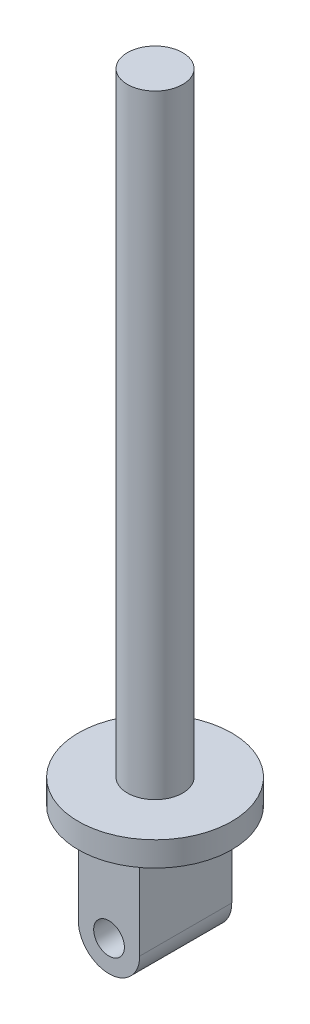
ISO-10303-21;
HEADER;
FILE_DESCRIPTION(('STEP AP214'),'2;1');
FILE_NAME('part.step','',(''),(''),'','','');
FILE_SCHEMA(('AUTOMOTIVE_DESIGN { 1 0 10303 214 1 1 1 1 }'));
ENDSEC;
DATA;
#1=APPLICATION_CONTEXT('core data for automotive mechanical design processes');
#2=APPLICATION_PROTOCOL_DEFINITION('international standard','automotive_design',2000,#1);
#3=PRODUCT_CONTEXT('',#1,'mechanical');
#4=PRODUCT('Part','Part','',(#3));
#5=PRODUCT_RELATED_PRODUCT_CATEGORY('part','',(#4));
#6=PRODUCT_DEFINITION_FORMATION('','',#4);
#7=PRODUCT_DEFINITION_CONTEXT('part definition',#1,'design');
#8=PRODUCT_DEFINITION('design','',#6,#7);
#9=PRODUCT_DEFINITION_SHAPE('','',#8);
#10=(LENGTH_UNIT() NAMED_UNIT(*) SI_UNIT(.MILLI.,.METRE.));
#11=(NAMED_UNIT(*) PLANE_ANGLE_UNIT() SI_UNIT($,.RADIAN.));
#12=(NAMED_UNIT(*) SI_UNIT($,.STERADIAN.) SOLID_ANGLE_UNIT());
#13=UNCERTAINTY_MEASURE_WITH_UNIT(LENGTH_MEASURE(1.E-05),#10,'distance_accuracy_value','');
#14=(GEOMETRIC_REPRESENTATION_CONTEXT(3) GLOBAL_UNCERTAINTY_ASSIGNED_CONTEXT((#13)) GLOBAL_UNIT_ASSIGNED_CONTEXT((#10,
#11,#12)) REPRESENTATION_CONTEXT('',''));
#15=CARTESIAN_POINT('',(0.,0.,0.));
#16=DIRECTION('',(0.,0.,1.));
#17=DIRECTION('',(1.,0.,0.));
#18=AXIS2_PLACEMENT_3D('',#15,#16,#17);
#19=CARTESIAN_POINT('',(25.,-8.,0.));
#20=DIRECTION('',(0.,-1.,0.));
#21=DIRECTION('',(0.,0.,-1.));
#22=AXIS2_PLACEMENT_3D('',#19,#20,#21);
#23=PLANE('',#22);
#24=CARTESIAN_POINT('',(0.,-8.,0.));
#25=DIRECTION('',(0.,-1.,0.));
#26=DIRECTION('',(0.,0.,-1.));
#27=AXIS2_PLACEMENT_3D('',#24,#25,#26);
#28=CIRCLE('',#27,25.);
#29=CARTESIAN_POINT('',(0.,-8.,-25.));
#30=VERTEX_POINT('',#29);
#31=EDGE_CURVE('E94',#30,#30,#28,.T.);
#32=ORIENTED_EDGE('',*,*,#31,.T.);
#33=EDGE_LOOP('',(#32));
#34=FACE_BOUND('',#33,.T.);
#35=DIRECTION('',(-1.,0.,0.));
#36=VECTOR('',#35,1.);
#37=CARTESIAN_POINT('',(-10.,-8.00000000000001,15.));
#38=LINE('',#37,#36);
#39=CARTESIAN_POINT('',(10.,-8.00000000000001,15.));
#40=VERTEX_POINT('',#39);
#41=CARTESIAN_POINT('',(-10.,-8.,15.));
#42=VERTEX_POINT('',#41);
#43=EDGE_CURVE('E82',#40,#42,#38,.T.);
#44=ORIENTED_EDGE('',*,*,#43,.F.);
#45=DIRECTION('',(0.,0.,-1.));
#46=VECTOR('',#45,1.);
#47=CARTESIAN_POINT('',(10.,-8.00000000000001,15.));
#48=LINE('',#47,#46);
#49=CARTESIAN_POINT('',(10.,-8.00000000000001,-15.));
#50=VERTEX_POINT('',#49);
#51=EDGE_CURVE('E88',#40,#50,#48,.T.);
#52=ORIENTED_EDGE('',*,*,#51,.T.);
#53=DIRECTION('',(-1.,0.,0.));
#54=VECTOR('',#53,1.);
#55=CARTESIAN_POINT('',(-10.,-8.00000000000001,-15.));
#56=LINE('',#55,#54);
#57=CARTESIAN_POINT('',(-10.,-8.00000000000001,-15.));
#58=VERTEX_POINT('',#57);
#59=EDGE_CURVE('E104',#50,#58,#56,.T.);
#60=ORIENTED_EDGE('',*,*,#59,.T.);
#61=DIRECTION('',(0.,0.,-1.));
#62=VECTOR('',#61,1.);
#63=CARTESIAN_POINT('',(-10.,-8.00000000000001,15.));
#64=LINE('',#63,#62);
#65=EDGE_CURVE('E95',#42,#58,#64,.T.);
#66=ORIENTED_EDGE('',*,*,#65,.F.);
#67=EDGE_LOOP('',(#44,#52,#60,#66));
#68=FACE_BOUND('',#67,.T.);
#69=ADVANCED_FACE('F34',(#34,#68),#23,.T.);
#70=CARTESIAN_POINT('',(0.,200.,0.));
#71=DIRECTION('',(0.,1.,0.));
#72=DIRECTION('',(0.,0.,1.));
#73=AXIS2_PLACEMENT_3D('',#70,#71,#72);
#74=PLANE('',#73);
#75=CARTESIAN_POINT('',(0.,200.,0.));
#76=DIRECTION('',(0.,-1.,0.));
#77=DIRECTION('',(0.,0.,-1.));
#78=AXIS2_PLACEMENT_3D('',#75,#76,#77);
#79=CIRCLE('',#78,9.00000000000005);
#80=CARTESIAN_POINT('',(0.,200.,-9.00000000000005));
#81=VERTEX_POINT('',#80);
#82=EDGE_CURVE('E11',#81,#81,#79,.T.);
#83=ORIENTED_EDGE('',*,*,#82,.F.);
#84=EDGE_LOOP('',(#83));
#85=FACE_BOUND('',#84,.T.);
#86=ADVANCED_FACE('F126',(#85),#74,.T.);
#87=CARTESIAN_POINT('',(0.,0.,0.));
#88=DIRECTION('',(0.,-1.,0.));
#89=DIRECTION('',(0.,0.,-1.));
#90=AXIS2_PLACEMENT_3D('',#87,#88,#89);
#91=CYLINDRICAL_SURFACE('',#90,9.00000000000004);
#92=ORIENTED_EDGE('',*,*,#82,.T.);
#93=EDGE_LOOP('',(#92));
#94=FACE_BOUND('',#93,.T.);
#95=CARTESIAN_POINT('',(0.,0.,0.));
#96=DIRECTION('',(0.,-1.,0.));
#97=DIRECTION('',(0.,0.,-1.));
#98=AXIS2_PLACEMENT_3D('',#95,#96,#97);
#99=CIRCLE('',#98,9.00000000000003);
#100=CARTESIAN_POINT('',(0.,0.,-9.00000000000003));
#101=VERTEX_POINT('',#100);
#102=EDGE_CURVE('E41',#101,#101,#99,.T.);
#103=ORIENTED_EDGE('',*,*,#102,.F.);
#104=EDGE_LOOP('',(#103));
#105=FACE_BOUND('',#104,.T.);
#106=ADVANCED_FACE('F124',(#94,#105),#91,.T.);
#107=CARTESIAN_POINT('',(9.00000000000003,0.,0.));
#108=DIRECTION('',(0.,1.,0.));
#109=DIRECTION('',(0.,0.,1.));
#110=AXIS2_PLACEMENT_3D('',#107,#108,#109);
#111=PLANE('',#110);
#112=ORIENTED_EDGE('',*,*,#102,.T.);
#113=EDGE_LOOP('',(#112));
#114=FACE_BOUND('',#113,.T.);
#115=CARTESIAN_POINT('',(0.,0.,0.));
#116=DIRECTION('',(0.,-1.,0.));
#117=DIRECTION('',(0.,0.,-1.));
#118=AXIS2_PLACEMENT_3D('',#115,#116,#117);
#119=CIRCLE('',#118,25.);
#120=CARTESIAN_POINT('',(0.,0.,-25.));
#121=VERTEX_POINT('',#120);
#122=EDGE_CURVE('E116',#121,#121,#119,.T.);
#123=ORIENTED_EDGE('',*,*,#122,.F.);
#124=EDGE_LOOP('',(#123));
#125=FACE_BOUND('',#124,.T.);
#126=ADVANCED_FACE('F121',(#114,#125),#111,.T.);
#127=CARTESIAN_POINT('',(0.,0.,0.));
#128=DIRECTION('',(0.,-1.,0.));
#129=DIRECTION('',(0.,0.,-1.));
#130=AXIS2_PLACEMENT_3D('',#127,#128,#129);
#131=CYLINDRICAL_SURFACE('',#130,25.);
#132=ORIENTED_EDGE('',*,*,#122,.T.);
#133=EDGE_LOOP('',(#132));
#134=FACE_BOUND('',#133,.T.);
#135=ORIENTED_EDGE('',*,*,#31,.F.);
#136=EDGE_LOOP('',(#135));
#137=FACE_BOUND('',#136,.T.);
#138=ADVANCED_FACE('F133',(#134,#137),#131,.T.);
#139=CARTESIAN_POINT('',(0.,-38.,15.));
#140=DIRECTION('',(0.,0.,1.));
#141=DIRECTION('',(1.,0.,0.));
#142=AXIS2_PLACEMENT_3D('',#139,#140,#141);
#143=PLANE('',#142);
#144=DIRECTION('',(0.,1.,0.));
#145=VECTOR('',#144,1.);
#146=CARTESIAN_POINT('',(10.,-8.00000000000001,15.));
#147=LINE('',#146,#145);
#148=CARTESIAN_POINT('',(9.99999999999999,-38.,15.));
#149=VERTEX_POINT('',#148);
#150=EDGE_CURVE('E77',#149,#40,#147,.T.);
#151=ORIENTED_EDGE('',*,*,#150,.T.);
#152=ORIENTED_EDGE('',*,*,#43,.T.);
#153=DIRECTION('',(0.,-1.,0.));
#154=VECTOR('',#153,1.);
#155=CARTESIAN_POINT('',(-10.,-8.00000000000001,15.));
#156=LINE('',#155,#154);
#157=CARTESIAN_POINT('',(-9.99999999999999,-38.,15.));
#158=VERTEX_POINT('',#157);
#159=EDGE_CURVE('E48',#42,#158,#156,.T.);
#160=ORIENTED_EDGE('',*,*,#159,.T.);
#161=CARTESIAN_POINT('',(0.,-38.,15.));
#162=DIRECTION('',(0.,0.,1.));
#163=DIRECTION('',(1.,0.,0.));
#164=AXIS2_PLACEMENT_3D('',#161,#162,#163);
#165=CIRCLE('',#164,10.);
#166=EDGE_CURVE('E56',#158,#149,#165,.T.);
#167=ORIENTED_EDGE('',*,*,#166,.T.);
#168=EDGE_LOOP('',(#151,#152,#160,#167));
#169=FACE_BOUND('',#168,.T.);
#170=CARTESIAN_POINT('',(0.,-38.,15.));
#171=DIRECTION('',(0.,0.,1.));
#172=DIRECTION('',(1.,0.,0.));
#173=AXIS2_PLACEMENT_3D('',#170,#171,#172);
#174=CIRCLE('',#173,5.);
#175=CARTESIAN_POINT('',(5.,-38.,15.));
#176=VERTEX_POINT('',#175);
#177=EDGE_CURVE('E105',#176,#176,#174,.T.);
#178=ORIENTED_EDGE('',*,*,#177,.F.);
#179=EDGE_LOOP('',(#178));
#180=FACE_BOUND('',#179,.T.);
#181=ADVANCED_FACE('F79',(#169,#180),#143,.T.);
#182=CARTESIAN_POINT('',(0.,-38.,-15.));
#183=DIRECTION('',(0.,0.,1.));
#184=DIRECTION('',(1.,0.,0.));
#185=AXIS2_PLACEMENT_3D('',#182,#183,#184);
#186=PLANE('',#185);
#187=DIRECTION('',(0.,1.,0.));
#188=VECTOR('',#187,1.);
#189=CARTESIAN_POINT('',(10.,-8.00000000000001,-15.));
#190=LINE('',#189,#188);
#191=CARTESIAN_POINT('',(9.99999999999999,-38.,-15.));
#192=VERTEX_POINT('',#191);
#193=EDGE_CURVE('E91',#192,#50,#190,.T.);
#194=ORIENTED_EDGE('',*,*,#193,.F.);
#195=CARTESIAN_POINT('',(0.,-38.,-15.));
#196=DIRECTION('',(0.,0.,1.));
#197=DIRECTION('',(1.,0.,0.));
#198=AXIS2_PLACEMENT_3D('',#195,#196,#197);
#199=CIRCLE('',#198,10.);
#200=CARTESIAN_POINT('',(-9.99999999999999,-38.,-15.));
#201=VERTEX_POINT('',#200);
#202=EDGE_CURVE('E74',#201,#192,#199,.T.);
#203=ORIENTED_EDGE('',*,*,#202,.F.);
#204=DIRECTION('',(0.,-1.,0.));
#205=VECTOR('',#204,1.);
#206=CARTESIAN_POINT('',(-10.,-8.00000000000001,-15.));
#207=LINE('',#206,#205);
#208=EDGE_CURVE('E107',#58,#201,#207,.T.);
#209=ORIENTED_EDGE('',*,*,#208,.F.);
#210=ORIENTED_EDGE('',*,*,#59,.F.);
#211=EDGE_LOOP('',(#194,#203,#209,#210));
#212=FACE_BOUND('',#211,.T.);
#213=CARTESIAN_POINT('',(0.,-38.,-15.));
#214=DIRECTION('',(0.,0.,1.));
#215=DIRECTION('',(1.,0.,0.));
#216=AXIS2_PLACEMENT_3D('',#213,#214,#215);
#217=CIRCLE('',#216,5.);
#218=CARTESIAN_POINT('',(5.,-38.,-15.));
#219=VERTEX_POINT('',#218);
#220=EDGE_CURVE('E172',#219,#219,#217,.T.);
#221=ORIENTED_EDGE('',*,*,#220,.T.);
#222=EDGE_LOOP('',(#221));
#223=FACE_BOUND('',#222,.T.);
#224=ADVANCED_FACE('F148',(#212,#223),#186,.F.);
#225=CARTESIAN_POINT('',(10.,-8.00000000000001,15.));
#226=DIRECTION('',(-1.,0.,0.));
#227=DIRECTION('',(0.,-1.,0.));
#228=AXIS2_PLACEMENT_3D('',#225,#226,#227);
#229=PLANE('',#228);
#230=ORIENTED_EDGE('',*,*,#193,.T.);
#231=ORIENTED_EDGE('',*,*,#51,.F.);
#232=ORIENTED_EDGE('',*,*,#150,.F.);
#233=DIRECTION('',(0.,0.,-1.));
#234=VECTOR('',#233,1.);
#235=CARTESIAN_POINT('',(9.99999999999999,-38.,15.));
#236=LINE('',#235,#234);
#237=EDGE_CURVE('E102',#149,#192,#236,.T.);
#238=ORIENTED_EDGE('',*,*,#237,.T.);
#239=EDGE_LOOP('',(#230,#231,#232,#238));
#240=FACE_BOUND('',#239,.T.);
#241=ADVANCED_FACE('F89',(#240),#229,.F.);
#242=CARTESIAN_POINT('',(-10.,-8.00000000000001,15.));
#243=DIRECTION('',(1.,0.,0.));
#244=DIRECTION('',(0.,1.,0.));
#245=AXIS2_PLACEMENT_3D('',#242,#243,#244);
#246=PLANE('',#245);
#247=ORIENTED_EDGE('',*,*,#208,.T.);
#248=DIRECTION('',(0.,0.,-1.));
#249=VECTOR('',#248,1.);
#250=CARTESIAN_POINT('',(-9.99999999999999,-38.,15.));
#251=LINE('',#250,#249);
#252=EDGE_CURVE('E111',#158,#201,#251,.T.);
#253=ORIENTED_EDGE('',*,*,#252,.F.);
#254=ORIENTED_EDGE('',*,*,#159,.F.);
#255=ORIENTED_EDGE('',*,*,#65,.T.);
#256=EDGE_LOOP('',(#247,#253,#254,#255));
#257=FACE_BOUND('',#256,.T.);
#258=ADVANCED_FACE('F153',(#257),#246,.F.);
#259=CARTESIAN_POINT('',(0.,-38.,15.));
#260=DIRECTION('',(0.,0.,-1.));
#261=DIRECTION('',(-1.,0.,0.));
#262=AXIS2_PLACEMENT_3D('',#259,#260,#261);
#263=CYLINDRICAL_SURFACE('',#262,10.);
#264=ORIENTED_EDGE('',*,*,#202,.T.);
#265=ORIENTED_EDGE('',*,*,#237,.F.);
#266=ORIENTED_EDGE('',*,*,#166,.F.);
#267=ORIENTED_EDGE('',*,*,#252,.T.);
#268=EDGE_LOOP('',(#264,#265,#266,#267));
#269=FACE_BOUND('',#268,.T.);
#270=ADVANCED_FACE('F156',(#269),#263,.T.);
#271=CARTESIAN_POINT('',(0.,-38.,15.));
#272=DIRECTION('',(0.,0.,-1.));
#273=DIRECTION('',(-1.,0.,0.));
#274=AXIS2_PLACEMENT_3D('',#271,#272,#273);
#275=CYLINDRICAL_SURFACE('',#274,5.);
#276=ORIENTED_EDGE('',*,*,#177,.T.);
#277=EDGE_LOOP('',(#276));
#278=FACE_BOUND('',#277,.T.);
#279=ORIENTED_EDGE('',*,*,#220,.F.);
#280=EDGE_LOOP('',(#279));
#281=FACE_BOUND('',#280,.T.);
#282=ADVANCED_FACE('F159',(#278,#281),#275,.F.);
#283=CLOSED_SHELL('',(#69,#86,#106,#126,#138,#181,#224,#241,#258,#270,#282));
#284=MANIFOLD_SOLID_BREP('B2',#283);
#285=ADVANCED_BREP_SHAPE_REPRESENTATION('',(#18,#284),#14);
#286=SHAPE_DEFINITION_REPRESENTATION(#9,#285);
ENDSEC;
END-ISO-10303-21;
